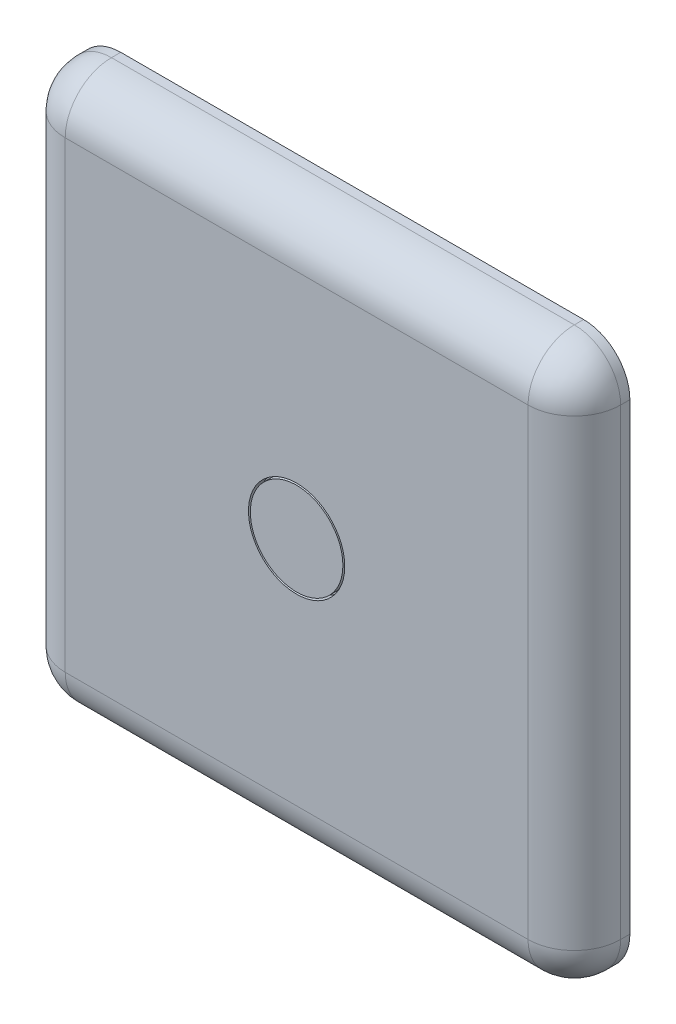
ISO-10303-21;
HEADER;
FILE_DESCRIPTION(('STEP AP214'),'2;1');
FILE_NAME('part.step','',(''),(''),'','','');
FILE_SCHEMA(('AUTOMOTIVE_DESIGN { 1 0 10303 214 1 1 1 1 }'));
ENDSEC;
DATA;
#1=APPLICATION_CONTEXT('core data for automotive mechanical design processes');
#2=APPLICATION_PROTOCOL_DEFINITION('international standard','automotive_design',2000,#1);
#3=PRODUCT_CONTEXT('',#1,'mechanical');
#4=PRODUCT('Part','Part','',(#3));
#5=PRODUCT_RELATED_PRODUCT_CATEGORY('part','',(#4));
#6=PRODUCT_DEFINITION_FORMATION('','',#4);
#7=PRODUCT_DEFINITION_CONTEXT('part definition',#1,'design');
#8=PRODUCT_DEFINITION('design','',#6,#7);
#9=PRODUCT_DEFINITION_SHAPE('','',#8);
#10=(LENGTH_UNIT() NAMED_UNIT(*) SI_UNIT(.MILLI.,.METRE.));
#11=(NAMED_UNIT(*) PLANE_ANGLE_UNIT() SI_UNIT($,.RADIAN.));
#12=(NAMED_UNIT(*) SI_UNIT($,.STERADIAN.) SOLID_ANGLE_UNIT());
#13=UNCERTAINTY_MEASURE_WITH_UNIT(LENGTH_MEASURE(1.E-05),#10,'distance_accuracy_value','');
#14=(GEOMETRIC_REPRESENTATION_CONTEXT(3) GLOBAL_UNCERTAINTY_ASSIGNED_CONTEXT((#13)) GLOBAL_UNIT_ASSIGNED_CONTEXT((#10,
#11,#12)) REPRESENTATION_CONTEXT('',''));
#15=CARTESIAN_POINT('',(0.,0.,0.));
#16=DIRECTION('',(0.,0.,1.));
#17=DIRECTION('',(1.,0.,0.));
#18=AXIS2_PLACEMENT_3D('',#15,#16,#17);
#19=CARTESIAN_POINT('',(15.,15.,-3.));
#20=DIRECTION('',(0.,0.,-1.));
#21=DIRECTION('',(-1.,0.,0.));
#22=AXIS2_PLACEMENT_3D('',#19,#20,#21);
#23=PLANE('',#22);
#24=CARTESIAN_POINT('',(15.,15.,-3.));
#25=DIRECTION('',(0.,0.,-1.));
#26=DIRECTION('',(-1.,0.,0.));
#27=AXIS2_PLACEMENT_3D('',#24,#25,#26);
#28=CIRCLE('',#27,2.5);
#29=CARTESIAN_POINT('',(17.5,15.,-3.));
#30=VERTEX_POINT('',#29);
#31=EDGE_CURVE('E17',#30,#30,#28,.T.);
#32=ORIENTED_EDGE('',*,*,#31,.T.);
#33=EDGE_LOOP('',(#32));
#34=FACE_BOUND('',#33,.T.);
#35=ADVANCED_FACE('F14',(#34),#23,.T.);
#36=CARTESIAN_POINT('',(15.,15.,3.));
#37=DIRECTION('',(0.,0.,-1.));
#38=DIRECTION('',(-1.,0.,0.));
#39=AXIS2_PLACEMENT_3D('',#36,#37,#38);
#40=CYLINDRICAL_SURFACE('',#39,2.5);
#41=CARTESIAN_POINT('',(15.,15.,-6.));
#42=DIRECTION('',(0.,0.,-1.));
#43=DIRECTION('',(-1.,0.,0.));
#44=AXIS2_PLACEMENT_3D('',#41,#42,#43);
#45=CIRCLE('',#44,2.5);
#46=CARTESIAN_POINT('',(12.5,15.,-6.));
#47=VERTEX_POINT('',#46);
#48=EDGE_CURVE('E32',#47,#47,#45,.T.);
#49=ORIENTED_EDGE('',*,*,#48,.T.);
#50=EDGE_LOOP('',(#49));
#51=FACE_BOUND('',#50,.T.);
#52=ORIENTED_EDGE('',*,*,#31,.F.);
#53=EDGE_LOOP('',(#52));
#54=FACE_BOUND('',#53,.T.);
#55=ADVANCED_FACE('F442',(#51,#54),#40,.F.);
#56=CARTESIAN_POINT('',(15.,15.,-6.));
#57=DIRECTION('',(0.,0.,1.));
#58=DIRECTION('',(1.,0.,0.));
#59=AXIS2_PLACEMENT_3D('',#56,#57,#58);
#60=PLANE('',#59);
#61=ORIENTED_EDGE('',*,*,#48,.F.);
#62=EDGE_LOOP('',(#61));
#63=FACE_BOUND('',#62,.T.);
#64=CARTESIAN_POINT('',(15.,15.,-6.00000000042655));
#65=DIRECTION('',(0.,0.,1.));
#66=DIRECTION('',(1.,0.,0.));
#67=AXIS2_PLACEMENT_3D('',#64,#65,#66);
#68=CIRCLE('',#67,2.75000000043292);
#69=CARTESIAN_POINT('',(12.2499999995671,15.,-6.00000000042655));
#70=VERTEX_POINT('',#69);
#71=EDGE_CURVE('E599',#70,#70,#68,.T.);
#72=ORIENTED_EDGE('',*,*,#71,.F.);
#73=EDGE_LOOP('',(#72));
#74=FACE_BOUND('',#73,.T.);
#75=ADVANCED_FACE('F439',(#63,#74),#60,.F.);
#76=CARTESIAN_POINT('',(15.,15.,-4.99999999954071));
#77=DIRECTION('',(0.,0.,1.));
#78=DIRECTION('',(1.,0.,0.));
#79=AXIS2_PLACEMENT_3D('',#76,#77,#78);
#80=CONICAL_SURFACE('',#79,3.74999999955662,0.785398162516375);
#81=CARTESIAN_POINT('',(15.,15.,-5.));
#82=DIRECTION('',(0.,0.,-1.));
#83=DIRECTION('',(-1.,0.,0.));
#84=AXIS2_PLACEMENT_3D('',#81,#82,#83);
#85=CIRCLE('',#84,3.75);
#86=CARTESIAN_POINT('',(11.2500000002217,15.,-4.99999999977035));
#87=VERTEX_POINT('',#86);
#88=EDGE_CURVE('E595',#87,#87,#85,.F.);
#89=ORIENTED_EDGE('',*,*,#88,.F.);
#90=EDGE_LOOP('',(#89));
#91=FACE_BOUND('',#90,.T.);
#92=ORIENTED_EDGE('',*,*,#71,.T.);
#93=EDGE_LOOP('',(#92));
#94=FACE_BOUND('',#93,.T.);
#95=ADVANCED_FACE('F435',(#91,#94),#80,.T.);
#96=CARTESIAN_POINT('',(15.,15.,0.));
#97=DIRECTION('',(0.,0.,-1.));
#98=DIRECTION('',(-1.,0.,0.));
#99=AXIS2_PLACEMENT_3D('',#96,#97,#98);
#100=CYLINDRICAL_SURFACE('',#99,3.75);
#101=ORIENTED_EDGE('',*,*,#88,.T.);
#102=EDGE_LOOP('',(#101));
#103=FACE_BOUND('',#102,.T.);
#104=CARTESIAN_POINT('',(15.,15.,0.));
#105=DIRECTION('',(0.,0.,-1.));
#106=DIRECTION('',(-1.,0.,0.));
#107=AXIS2_PLACEMENT_3D('',#104,#105,#106);
#108=CIRCLE('',#107,3.75);
#109=CARTESIAN_POINT('',(11.25,15.,0.));
#110=VERTEX_POINT('',#109);
#111=EDGE_CURVE('E598',#110,#110,#108,.T.);
#112=ORIENTED_EDGE('',*,*,#111,.T.);
#113=EDGE_LOOP('',(#112));
#114=FACE_BOUND('',#113,.T.);
#115=ADVANCED_FACE('F431',(#103,#114),#100,.T.);
#116=CARTESIAN_POINT('',(15.,15.,0.));
#117=DIRECTION('',(0.,0.,1.));
#118=DIRECTION('',(1.,0.,0.));
#119=AXIS2_PLACEMENT_3D('',#116,#117,#118);
#120=PLANE('',#119);
#121=ORIENTED_EDGE('',*,*,#111,.F.);
#122=EDGE_LOOP('',(#121));
#123=FACE_BOUND('',#122,.T.);
#124=CARTESIAN_POINT('',(15.,15.,0.));
#125=DIRECTION('',(0.,0.,-1.));
#126=DIRECTION('',(-1.,0.,0.));
#127=AXIS2_PLACEMENT_3D('',#124,#125,#126);
#128=CIRCLE('',#127,4.75);
#129=CARTESIAN_POINT('',(10.25,15.,0.));
#130=VERTEX_POINT('',#129);
#131=EDGE_CURVE('E589',#130,#130,#128,.F.);
#132=ORIENTED_EDGE('',*,*,#131,.F.);
#133=EDGE_LOOP('',(#132));
#134=FACE_BOUND('',#133,.T.);
#135=ADVANCED_FACE('F427',(#123,#134),#120,.F.);
#136=CARTESIAN_POINT('',(15.,15.,1.));
#137=DIRECTION('',(0.,0.,-1.));
#138=DIRECTION('',(-1.,0.,0.));
#139=AXIS2_PLACEMENT_3D('',#136,#137,#138);
#140=CYLINDRICAL_SURFACE('',#139,4.75);
#141=CARTESIAN_POINT('',(15.,15.,1.));
#142=DIRECTION('',(0.,0.,-1.));
#143=DIRECTION('',(-1.,0.,0.));
#144=AXIS2_PLACEMENT_3D('',#141,#142,#143);
#145=CIRCLE('',#144,4.75);
#146=CARTESIAN_POINT('',(10.25,15.,1.));
#147=VERTEX_POINT('',#146);
#148=EDGE_CURVE('E588',#147,#147,#145,.T.);
#149=ORIENTED_EDGE('',*,*,#148,.T.);
#150=EDGE_LOOP('',(#149));
#151=FACE_BOUND('',#150,.T.);
#152=ORIENTED_EDGE('',*,*,#131,.T.);
#153=EDGE_LOOP('',(#152));
#154=FACE_BOUND('',#153,.T.);
#155=ADVANCED_FACE('F423',(#151,#154),#140,.T.);
#156=CARTESIAN_POINT('',(30.,30.,1.));
#157=DIRECTION('',(0.,0.,1.));
#158=DIRECTION('',(1.,0.,0.));
#159=AXIS2_PLACEMENT_3D('',#156,#157,#158);
#160=PLANE('',#159);
#161=ORIENTED_EDGE('',*,*,#148,.F.);
#162=EDGE_LOOP('',(#161));
#163=FACE_BOUND('',#162,.T.);
#164=DIRECTION('',(1.,0.,0.));
#165=VECTOR('',#164,1.);
#166=CARTESIAN_POINT('',(15.,27.5,1.));
#167=LINE('',#166,#165);
#168=CARTESIAN_POINT('',(2.5,27.5,1.));
#169=VERTEX_POINT('',#168);
#170=CARTESIAN_POINT('',(27.5,27.5,1.));
#171=VERTEX_POINT('',#170);
#172=EDGE_CURVE('E559',#169,#171,#167,.T.);
#173=ORIENTED_EDGE('',*,*,#172,.T.);
#174=DIRECTION('',(0.,-1.,0.));
#175=VECTOR('',#174,1.);
#176=CARTESIAN_POINT('',(27.5,30.,1.));
#177=LINE('',#176,#175);
#178=CARTESIAN_POINT('',(27.5,2.5,1.));
#179=VERTEX_POINT('',#178);
#180=EDGE_CURVE('E355',#171,#179,#177,.T.);
#181=ORIENTED_EDGE('',*,*,#180,.T.);
#182=DIRECTION('',(-1.,0.,0.));
#183=VECTOR('',#182,1.);
#184=CARTESIAN_POINT('',(30.,2.5,1.));
#185=LINE('',#184,#183);
#186=CARTESIAN_POINT('',(2.5,2.5,1.));
#187=VERTEX_POINT('',#186);
#188=EDGE_CURVE('E586',#179,#187,#185,.T.);
#189=ORIENTED_EDGE('',*,*,#188,.T.);
#190=DIRECTION('',(0.,1.,0.));
#191=VECTOR('',#190,1.);
#192=CARTESIAN_POINT('',(2.5,15.,1.));
#193=LINE('',#192,#191);
#194=EDGE_CURVE('E398',#187,#169,#193,.T.);
#195=ORIENTED_EDGE('',*,*,#194,.T.);
#196=EDGE_LOOP('',(#173,#181,#189,#195));
#197=FACE_BOUND('',#196,.T.);
#198=ADVANCED_FACE('F419',(#163,#197),#160,.F.);
#199=CARTESIAN_POINT('',(30.,2.5,0.5));
#200=DIRECTION('',(-1.,0.,0.));
#201=DIRECTION('',(0.,0.,1.));
#202=AXIS2_PLACEMENT_3D('',#199,#200,#201);
#203=CYLINDRICAL_SURFACE('',#202,0.5);
#204=CARTESIAN_POINT('',(2.5,2.5,0.5));
#205=DIRECTION('',(1.,0.,0.));
#206=DIRECTION('',(0.,1.,0.));
#207=AXIS2_PLACEMENT_3D('',#204,#205,#206);
#208=CIRCLE('',#207,0.5);
#209=CARTESIAN_POINT('',(2.5,2.,0.5));
#210=VERTEX_POINT('',#209);
#211=EDGE_CURVE('E406',#210,#187,#208,.F.);
#212=ORIENTED_EDGE('',*,*,#211,.T.);
#213=ORIENTED_EDGE('',*,*,#188,.F.);
#214=CARTESIAN_POINT('',(27.5,2.5,0.5));
#215=DIRECTION('',(1.,0.,0.));
#216=DIRECTION('',(0.,1.,0.));
#217=AXIS2_PLACEMENT_3D('',#214,#215,#216);
#218=CIRCLE('',#217,0.5);
#219=CARTESIAN_POINT('',(27.5,2.,0.5));
#220=VERTEX_POINT('',#219);
#221=EDGE_CURVE('E354',#179,#220,#218,.T.);
#222=ORIENTED_EDGE('',*,*,#221,.T.);
#223=DIRECTION('',(1.,0.,0.));
#224=VECTOR('',#223,1.);
#225=CARTESIAN_POINT('',(30.,2.,0.5));
#226=LINE('',#225,#224);
#227=EDGE_CURVE('E361',#220,#210,#226,.F.);
#228=ORIENTED_EDGE('',*,*,#227,.T.);
#229=EDGE_LOOP('',(#212,#213,#222,#228));
#230=FACE_BOUND('',#229,.T.);
#231=ADVANCED_FACE('F415',(#230),#203,.F.);
#232=CARTESIAN_POINT('',(2.5,2.5,0.5));
#233=DIRECTION('',(1.,0.,0.));
#234=DIRECTION('',(0.,1.,0.));
#235=AXIS2_PLACEMENT_3D('',#232,#233,#234);
#236=SPHERICAL_SURFACE('',#235,0.5);
#237=CARTESIAN_POINT('',(2.5,2.5,0.5));
#238=DIRECTION('',(0.,1.,0.));
#239=DIRECTION('',(0.,0.,1.));
#240=AXIS2_PLACEMENT_3D('',#237,#238,#239);
#241=CIRCLE('',#240,0.5);
#242=CARTESIAN_POINT('',(2.,2.5,0.5));
#243=VERTEX_POINT('',#242);
#244=EDGE_CURVE('E403',#243,#187,#241,.T.);
#245=ORIENTED_EDGE('',*,*,#244,.T.);
#246=ORIENTED_EDGE('',*,*,#211,.F.);
#247=CARTESIAN_POINT('',(2.5,2.5,0.5));
#248=DIRECTION('',(0.,0.,1.));
#249=DIRECTION('',(1.,0.,0.));
#250=AXIS2_PLACEMENT_3D('',#247,#248,#249);
#251=CIRCLE('',#250,0.5);
#252=EDGE_CURVE('E407',#210,#243,#251,.F.);
#253=ORIENTED_EDGE('',*,*,#252,.T.);
#254=EDGE_LOOP('',(#245,#246,#253));
#255=FACE_BOUND('',#254,.T.);
#256=ADVANCED_FACE('F412',(#255),#236,.F.);
#257=CARTESIAN_POINT('',(2.5,15.,0.5));
#258=DIRECTION('',(0.,1.,0.));
#259=DIRECTION('',(0.,0.,1.));
#260=AXIS2_PLACEMENT_3D('',#257,#258,#259);
#261=CYLINDRICAL_SURFACE('',#260,0.5);
#262=CARTESIAN_POINT('',(2.5,27.5,0.5));
#263=DIRECTION('',(0.,-1.,0.));
#264=DIRECTION('',(1.,0.,0.));
#265=AXIS2_PLACEMENT_3D('',#262,#263,#264);
#266=CIRCLE('',#265,0.5);
#267=CARTESIAN_POINT('',(2.,27.5,0.5));
#268=VERTEX_POINT('',#267);
#269=EDGE_CURVE('E394',#268,#169,#266,.F.);
#270=ORIENTED_EDGE('',*,*,#269,.T.);
#271=ORIENTED_EDGE('',*,*,#194,.F.);
#272=ORIENTED_EDGE('',*,*,#244,.F.);
#273=DIRECTION('',(0.,1.,0.));
#274=VECTOR('',#273,1.);
#275=CARTESIAN_POINT('',(2.,0.,0.5));
#276=LINE('',#275,#274);
#277=EDGE_CURVE('E399',#243,#268,#276,.T.);
#278=ORIENTED_EDGE('',*,*,#277,.T.);
#279=EDGE_LOOP('',(#270,#271,#272,#278));
#280=FACE_BOUND('',#279,.T.);
#281=ADVANCED_FACE('F386',(#280),#261,.F.);
#282=CARTESIAN_POINT('',(2.5,27.5,0.5));
#283=DIRECTION('',(1.,0.,0.));
#284=DIRECTION('',(0.,1.,0.));
#285=AXIS2_PLACEMENT_3D('',#282,#283,#284);
#286=SPHERICAL_SURFACE('',#285,0.5);
#287=CARTESIAN_POINT('',(2.5,27.5,0.5));
#288=DIRECTION('',(1.,0.,0.));
#289=DIRECTION('',(0.,0.,-1.));
#290=AXIS2_PLACEMENT_3D('',#287,#288,#289);
#291=CIRCLE('',#290,0.5);
#292=CARTESIAN_POINT('',(2.5,28.,0.5));
#293=VERTEX_POINT('',#292);
#294=EDGE_CURVE('E397',#293,#169,#291,.T.);
#295=ORIENTED_EDGE('',*,*,#294,.T.);
#296=ORIENTED_EDGE('',*,*,#269,.F.);
#297=CARTESIAN_POINT('',(2.5,27.5,0.5));
#298=DIRECTION('',(0.,0.,1.));
#299=DIRECTION('',(1.,0.,0.));
#300=AXIS2_PLACEMENT_3D('',#297,#298,#299);
#301=CIRCLE('',#300,0.5);
#302=EDGE_CURVE('E392',#268,#293,#301,.F.);
#303=ORIENTED_EDGE('',*,*,#302,.T.);
#304=EDGE_LOOP('',(#295,#296,#303));
#305=FACE_BOUND('',#304,.T.);
#306=ADVANCED_FACE('F381',(#305),#286,.F.);
#307=CARTESIAN_POINT('',(15.,27.5,0.5));
#308=DIRECTION('',(1.,0.,0.));
#309=DIRECTION('',(0.,0.,-1.));
#310=AXIS2_PLACEMENT_3D('',#307,#308,#309);
#311=CYLINDRICAL_SURFACE('',#310,0.5);
#312=CARTESIAN_POINT('',(27.5,27.5,0.5));
#313=DIRECTION('',(1.,0.,0.));
#314=DIRECTION('',(0.,1.,0.));
#315=AXIS2_PLACEMENT_3D('',#312,#313,#314);
#316=CIRCLE('',#315,0.5);
#317=CARTESIAN_POINT('',(27.5,28.,0.5));
#318=VERTEX_POINT('',#317);
#319=EDGE_CURVE('E367',#318,#171,#316,.T.);
#320=ORIENTED_EDGE('',*,*,#319,.T.);
#321=ORIENTED_EDGE('',*,*,#172,.F.);
#322=ORIENTED_EDGE('',*,*,#294,.F.);
#323=DIRECTION('',(1.,0.,0.));
#324=VECTOR('',#323,1.);
#325=CARTESIAN_POINT('',(0.,28.,0.5));
#326=LINE('',#325,#324);
#327=EDGE_CURVE('E529',#293,#318,#326,.T.);
#328=ORIENTED_EDGE('',*,*,#327,.T.);
#329=EDGE_LOOP('',(#320,#321,#322,#328));
#330=FACE_BOUND('',#329,.T.);
#331=ADVANCED_FACE('F377',(#330),#311,.F.);
#332=CARTESIAN_POINT('',(27.5,27.5,0.5));
#333=DIRECTION('',(1.,0.,0.));
#334=DIRECTION('',(0.,1.,0.));
#335=AXIS2_PLACEMENT_3D('',#332,#333,#334);
#336=SPHERICAL_SURFACE('',#335,0.5);
#337=CARTESIAN_POINT('',(27.5,27.5,0.5));
#338=DIRECTION('',(0.,-1.,0.));
#339=DIRECTION('',(0.,0.,-1.));
#340=AXIS2_PLACEMENT_3D('',#337,#338,#339);
#341=CIRCLE('',#340,0.5);
#342=CARTESIAN_POINT('',(28.,27.5,0.5));
#343=VERTEX_POINT('',#342);
#344=EDGE_CURVE('E364',#343,#171,#341,.T.);
#345=ORIENTED_EDGE('',*,*,#344,.T.);
#346=ORIENTED_EDGE('',*,*,#319,.F.);
#347=CARTESIAN_POINT('',(27.5,27.5,0.5));
#348=DIRECTION('',(0.,0.,1.));
#349=DIRECTION('',(1.,0.,0.));
#350=AXIS2_PLACEMENT_3D('',#347,#348,#349);
#351=CIRCLE('',#350,0.5);
#352=EDGE_CURVE('E368',#318,#343,#351,.F.);
#353=ORIENTED_EDGE('',*,*,#352,.T.);
#354=EDGE_LOOP('',(#345,#346,#353));
#355=FACE_BOUND('',#354,.T.);
#356=ADVANCED_FACE('F374',(#355),#336,.F.);
#357=CARTESIAN_POINT('',(27.5,30.,0.5));
#358=DIRECTION('',(0.,-1.,0.));
#359=DIRECTION('',(0.,0.,-1.));
#360=AXIS2_PLACEMENT_3D('',#357,#358,#359);
#361=CYLINDRICAL_SURFACE('',#360,0.5);
#362=CARTESIAN_POINT('',(27.5,2.5,0.5));
#363=DIRECTION('',(0.,-1.,0.));
#364=DIRECTION('',(1.,0.,0.));
#365=AXIS2_PLACEMENT_3D('',#362,#363,#364);
#366=CIRCLE('',#365,0.5);
#367=CARTESIAN_POINT('',(28.,2.5,0.5));
#368=VERTEX_POINT('',#367);
#369=EDGE_CURVE('E351',#368,#179,#366,.T.);
#370=ORIENTED_EDGE('',*,*,#369,.T.);
#371=ORIENTED_EDGE('',*,*,#180,.F.);
#372=ORIENTED_EDGE('',*,*,#344,.F.);
#373=DIRECTION('',(0.,1.,0.));
#374=VECTOR('',#373,1.);
#375=CARTESIAN_POINT('',(28.,30.,0.5));
#376=LINE('',#375,#374);
#377=EDGE_CURVE('E347',#343,#368,#376,.F.);
#378=ORIENTED_EDGE('',*,*,#377,.T.);
#379=EDGE_LOOP('',(#370,#371,#372,#378));
#380=FACE_BOUND('',#379,.T.);
#381=ADVANCED_FACE('F339',(#380),#361,.F.);
#382=CARTESIAN_POINT('',(27.5,2.5,0.5));
#383=DIRECTION('',(1.,0.,0.));
#384=DIRECTION('',(0.,1.,0.));
#385=AXIS2_PLACEMENT_3D('',#382,#383,#384);
#386=SPHERICAL_SURFACE('',#385,0.5);
#387=ORIENTED_EDGE('',*,*,#221,.F.);
#388=ORIENTED_EDGE('',*,*,#369,.F.);
#389=CARTESIAN_POINT('',(27.5,2.5,0.5));
#390=DIRECTION('',(0.,0.,1.));
#391=DIRECTION('',(1.,0.,0.));
#392=AXIS2_PLACEMENT_3D('',#389,#390,#391);
#393=CIRCLE('',#392,0.5);
#394=EDGE_CURVE('E356',#368,#220,#393,.F.);
#395=ORIENTED_EDGE('',*,*,#394,.T.);
#396=EDGE_LOOP('',(#387,#388,#395));
#397=FACE_BOUND('',#396,.T.);
#398=ADVANCED_FACE('F334',(#397),#386,.F.);
#399=CARTESIAN_POINT('',(30.,2.,0.));
#400=DIRECTION('',(0.,-1.,0.));
#401=DIRECTION('',(0.,0.,-1.));
#402=AXIS2_PLACEMENT_3D('',#399,#400,#401);
#403=PLANE('',#402);
#404=DIRECTION('',(0.,0.,1.));
#405=VECTOR('',#404,1.);
#406=CARTESIAN_POINT('',(27.5,2.,0.));
#407=LINE('',#406,#405);
#408=CARTESIAN_POINT('',(27.5,2.,0.));
#409=VERTEX_POINT('',#408);
#410=EDGE_CURVE('E349',#220,#409,#407,.F.);
#411=ORIENTED_EDGE('',*,*,#410,.T.);
#412=DIRECTION('',(1.,0.,0.));
#413=VECTOR('',#412,1.);
#414=CARTESIAN_POINT('',(15.,2.,0.));
#415=LINE('',#414,#413);
#416=CARTESIAN_POINT('',(2.5,2.,0.));
#417=VERTEX_POINT('',#416);
#418=EDGE_CURVE('E584',#409,#417,#415,.F.);
#419=ORIENTED_EDGE('',*,*,#418,.T.);
#420=DIRECTION('',(0.,0.,1.));
#421=VECTOR('',#420,1.);
#422=CARTESIAN_POINT('',(2.5,2.,0.));
#423=LINE('',#422,#421);
#424=EDGE_CURVE('E345',#417,#210,#423,.T.);
#425=ORIENTED_EDGE('',*,*,#424,.T.);
#426=ORIENTED_EDGE('',*,*,#227,.F.);
#427=EDGE_LOOP('',(#411,#419,#425,#426));
#428=FACE_BOUND('',#427,.T.);
#429=ADVANCED_FACE('F330',(#428),#403,.F.);
#430=CARTESIAN_POINT('',(2.5,2.5,0.));
#431=DIRECTION('',(0.,0.,1.));
#432=DIRECTION('',(1.,0.,0.));
#433=AXIS2_PLACEMENT_3D('',#430,#431,#432);
#434=CYLINDRICAL_SURFACE('',#433,0.5);
#435=ORIENTED_EDGE('',*,*,#424,.F.);
#436=CARTESIAN_POINT('',(2.5,2.5,0.));
#437=DIRECTION('',(0.,0.,1.));
#438=DIRECTION('',(1.,0.,0.));
#439=AXIS2_PLACEMENT_3D('',#436,#437,#438);
#440=CIRCLE('',#439,0.5);
#441=CARTESIAN_POINT('',(2.,2.5,0.));
#442=VERTEX_POINT('',#441);
#443=EDGE_CURVE('E540',#417,#442,#440,.F.);
#444=ORIENTED_EDGE('',*,*,#443,.T.);
#445=DIRECTION('',(0.,0.,1.));
#446=VECTOR('',#445,1.);
#447=CARTESIAN_POINT('',(2.,2.5,0.));
#448=LINE('',#447,#446);
#449=EDGE_CURVE('E402',#442,#243,#448,.T.);
#450=ORIENTED_EDGE('',*,*,#449,.T.);
#451=ORIENTED_EDGE('',*,*,#252,.F.);
#452=EDGE_LOOP('',(#435,#444,#450,#451));
#453=FACE_BOUND('',#452,.T.);
#454=ADVANCED_FACE('F326',(#453),#434,.F.);
#455=CARTESIAN_POINT('',(2.,0.,0.));
#456=DIRECTION('',(-1.,0.,0.));
#457=DIRECTION('',(0.,0.,1.));
#458=AXIS2_PLACEMENT_3D('',#455,#456,#457);
#459=PLANE('',#458);
#460=ORIENTED_EDGE('',*,*,#449,.F.);
#461=DIRECTION('',(0.,1.,0.));
#462=VECTOR('',#461,1.);
#463=CARTESIAN_POINT('',(2.,15.,0.));
#464=LINE('',#463,#462);
#465=CARTESIAN_POINT('',(2.,27.5,0.));
#466=VERTEX_POINT('',#465);
#467=EDGE_CURVE('E548',#442,#466,#464,.T.);
#468=ORIENTED_EDGE('',*,*,#467,.T.);
#469=DIRECTION('',(0.,0.,1.));
#470=VECTOR('',#469,1.);
#471=CARTESIAN_POINT('',(2.,27.5,0.));
#472=LINE('',#471,#470);
#473=EDGE_CURVE('E401',#466,#268,#472,.T.);
#474=ORIENTED_EDGE('',*,*,#473,.T.);
#475=ORIENTED_EDGE('',*,*,#277,.F.);
#476=EDGE_LOOP('',(#460,#468,#474,#475));
#477=FACE_BOUND('',#476,.T.);
#478=ADVANCED_FACE('F322',(#477),#459,.F.);
#479=CARTESIAN_POINT('',(2.5,27.5,0.));
#480=DIRECTION('',(0.,0.,1.));
#481=DIRECTION('',(1.,0.,0.));
#482=AXIS2_PLACEMENT_3D('',#479,#480,#481);
#483=CYLINDRICAL_SURFACE('',#482,0.5);
#484=ORIENTED_EDGE('',*,*,#473,.F.);
#485=CARTESIAN_POINT('',(2.5,27.5,0.));
#486=DIRECTION('',(0.,0.,1.));
#487=DIRECTION('',(1.,0.,0.));
#488=AXIS2_PLACEMENT_3D('',#485,#486,#487);
#489=CIRCLE('',#488,0.5);
#490=CARTESIAN_POINT('',(2.5,28.,0.));
#491=VERTEX_POINT('',#490);
#492=EDGE_CURVE('E555',#466,#491,#489,.F.);
#493=ORIENTED_EDGE('',*,*,#492,.T.);
#494=DIRECTION('',(0.,0.,1.));
#495=VECTOR('',#494,1.);
#496=CARTESIAN_POINT('',(2.5,28.,0.));
#497=LINE('',#496,#495);
#498=EDGE_CURVE('E530',#491,#293,#497,.T.);
#499=ORIENTED_EDGE('',*,*,#498,.T.);
#500=ORIENTED_EDGE('',*,*,#302,.F.);
#501=EDGE_LOOP('',(#484,#493,#499,#500));
#502=FACE_BOUND('',#501,.T.);
#503=ADVANCED_FACE('F318',(#502),#483,.F.);
#504=CARTESIAN_POINT('',(0.,28.,0.));
#505=DIRECTION('',(0.,1.,0.));
#506=DIRECTION('',(0.,0.,1.));
#507=AXIS2_PLACEMENT_3D('',#504,#505,#506);
#508=PLANE('',#507);
#509=ORIENTED_EDGE('',*,*,#498,.F.);
#510=DIRECTION('',(1.,0.,0.));
#511=VECTOR('',#510,1.);
#512=CARTESIAN_POINT('',(15.,28.,0.));
#513=LINE('',#512,#511);
#514=CARTESIAN_POINT('',(27.5,28.,0.));
#515=VERTEX_POINT('',#514);
#516=EDGE_CURVE('E562',#491,#515,#513,.T.);
#517=ORIENTED_EDGE('',*,*,#516,.T.);
#518=DIRECTION('',(0.,0.,1.));
#519=VECTOR('',#518,1.);
#520=CARTESIAN_POINT('',(27.5,28.,0.));
#521=LINE('',#520,#519);
#522=EDGE_CURVE('E370',#515,#318,#521,.T.);
#523=ORIENTED_EDGE('',*,*,#522,.T.);
#524=ORIENTED_EDGE('',*,*,#327,.F.);
#525=EDGE_LOOP('',(#509,#517,#523,#524));
#526=FACE_BOUND('',#525,.T.);
#527=ADVANCED_FACE('F314',(#526),#508,.F.);
#528=CARTESIAN_POINT('',(27.5,27.5,0.));
#529=DIRECTION('',(0.,0.,1.));
#530=DIRECTION('',(1.,0.,0.));
#531=AXIS2_PLACEMENT_3D('',#528,#529,#530);
#532=CYLINDRICAL_SURFACE('',#531,0.5);
#533=ORIENTED_EDGE('',*,*,#522,.F.);
#534=CARTESIAN_POINT('',(27.5,27.5,0.));
#535=DIRECTION('',(0.,0.,1.));
#536=DIRECTION('',(1.,0.,0.));
#537=AXIS2_PLACEMENT_3D('',#534,#535,#536);
#538=CIRCLE('',#537,0.5);
#539=CARTESIAN_POINT('',(28.,27.5,0.));
#540=VERTEX_POINT('',#539);
#541=EDGE_CURVE('E568',#515,#540,#538,.F.);
#542=ORIENTED_EDGE('',*,*,#541,.T.);
#543=DIRECTION('',(0.,0.,-1.));
#544=VECTOR('',#543,1.);
#545=CARTESIAN_POINT('',(28.,27.5,0.));
#546=LINE('',#545,#544);
#547=EDGE_CURVE('E350',#540,#343,#546,.F.);
#548=ORIENTED_EDGE('',*,*,#547,.T.);
#549=ORIENTED_EDGE('',*,*,#352,.F.);
#550=EDGE_LOOP('',(#533,#542,#548,#549));
#551=FACE_BOUND('',#550,.T.);
#552=ADVANCED_FACE('F310',(#551),#532,.F.);
#553=CARTESIAN_POINT('',(28.,30.,0.));
#554=DIRECTION('',(1.,0.,0.));
#555=DIRECTION('',(0.,0.,-1.));
#556=AXIS2_PLACEMENT_3D('',#553,#554,#555);
#557=PLANE('',#556);
#558=ORIENTED_EDGE('',*,*,#547,.F.);
#559=DIRECTION('',(0.,1.,0.));
#560=VECTOR('',#559,1.);
#561=CARTESIAN_POINT('',(28.,15.,0.));
#562=LINE('',#561,#560);
#563=CARTESIAN_POINT('',(28.,2.5,0.));
#564=VERTEX_POINT('',#563);
#565=EDGE_CURVE('E261',#540,#564,#562,.F.);
#566=ORIENTED_EDGE('',*,*,#565,.T.);
#567=DIRECTION('',(0.,0.,1.));
#568=VECTOR('',#567,1.);
#569=CARTESIAN_POINT('',(28.,2.5,0.));
#570=LINE('',#569,#568);
#571=EDGE_CURVE('E360',#564,#368,#570,.T.);
#572=ORIENTED_EDGE('',*,*,#571,.T.);
#573=ORIENTED_EDGE('',*,*,#377,.F.);
#574=EDGE_LOOP('',(#558,#566,#572,#573));
#575=FACE_BOUND('',#574,.T.);
#576=ADVANCED_FACE('F306',(#575),#557,.F.);
#577=CARTESIAN_POINT('',(27.5,2.5,0.));
#578=DIRECTION('',(0.,0.,1.));
#579=DIRECTION('',(1.,0.,0.));
#580=AXIS2_PLACEMENT_3D('',#577,#578,#579);
#581=CYLINDRICAL_SURFACE('',#580,0.5);
#582=ORIENTED_EDGE('',*,*,#571,.F.);
#583=CARTESIAN_POINT('',(27.5,2.5,0.));
#584=DIRECTION('',(0.,0.,1.));
#585=DIRECTION('',(1.,0.,0.));
#586=AXIS2_PLACEMENT_3D('',#583,#584,#585);
#587=CIRCLE('',#586,0.5);
#588=EDGE_CURVE('E580',#564,#409,#587,.F.);
#589=ORIENTED_EDGE('',*,*,#588,.T.);
#590=ORIENTED_EDGE('',*,*,#410,.F.);
#591=ORIENTED_EDGE('',*,*,#394,.F.);
#592=EDGE_LOOP('',(#582,#589,#590,#591));
#593=FACE_BOUND('',#592,.T.);
#594=ADVANCED_FACE('F302',(#593),#581,.F.);
#595=CARTESIAN_POINT('',(30.,30.,3.));
#596=DIRECTION('',(0.,0.,1.));
#597=DIRECTION('',(1.,0.,0.));
#598=AXIS2_PLACEMENT_3D('',#595,#596,#597);
#599=PLANE('',#598);
#600=CARTESIAN_POINT('',(15.,15.,3.));
#601=DIRECTION('',(0.,0.,-1.));
#602=DIRECTION('',(-1.,0.,0.));
#603=AXIS2_PLACEMENT_3D('',#600,#601,#602);
#604=CIRCLE('',#603,2.5);
#605=CARTESIAN_POINT('',(17.5,15.,3.));
#606=VERTEX_POINT('',#605);
#607=EDGE_CURVE('E510',#606,#606,#604,.T.);
#608=ORIENTED_EDGE('',*,*,#607,.F.);
#609=EDGE_LOOP('',(#608));
#610=FACE_BOUND('',#609,.T.);
#611=ADVANCED_FACE('F298',(#610),#599,.T.);
#612=CARTESIAN_POINT('',(2.5,2.5,0.));
#613=DIRECTION('',(0.,0.,1.));
#614=DIRECTION('',(1.,0.,0.));
#615=AXIS2_PLACEMENT_3D('',#612,#613,#614);
#616=CYLINDRICAL_SURFACE('',#615,2.5);
#617=CARTESIAN_POINT('',(2.5,2.5,0.));
#618=DIRECTION('',(0.,0.,1.));
#619=DIRECTION('',(1.,0.,0.));
#620=AXIS2_PLACEMENT_3D('',#617,#618,#619);
#621=CIRCLE('',#620,2.5);
#622=CARTESIAN_POINT('',(0.,2.5,0.));
#623=VERTEX_POINT('',#622);
#624=CARTESIAN_POINT('',(2.5,0.,0.));
#625=VERTEX_POINT('',#624);
#626=EDGE_CURVE('E359',#623,#625,#621,.T.);
#627=ORIENTED_EDGE('',*,*,#626,.T.);
#628=DIRECTION('',(0.,0.,-1.));
#629=VECTOR('',#628,1.);
#630=CARTESIAN_POINT('',(2.5,0.,0.));
#631=LINE('',#630,#629);
#632=CARTESIAN_POINT('',(2.5,0.,0.499999999999521));
#633=VERTEX_POINT('',#632);
#634=EDGE_CURVE('E491',#633,#625,#631,.T.);
#635=ORIENTED_EDGE('',*,*,#634,.F.);
#636=CARTESIAN_POINT('',(2.5,2.5,0.5));
#637=DIRECTION('',(0.,1.5328734877225E-12,-1.));
#638=DIRECTION('',(1.,0.,0.));
#639=AXIS2_PLACEMENT_3D('',#636,#637,#638);
#640=CIRCLE('',#639,2.5);
#641=CARTESIAN_POINT('',(0.,2.5,0.5));
#642=VERTEX_POINT('',#641);
#643=EDGE_CURVE('E501',#642,#633,#640,.F.);
#644=ORIENTED_EDGE('',*,*,#643,.F.);
#645=DIRECTION('',(0.,0.,1.));
#646=VECTOR('',#645,1.);
#647=CARTESIAN_POINT('',(0.,2.5,0.));
#648=LINE('',#647,#646);
#649=EDGE_CURVE('E495',#623,#642,#648,.T.);
#650=ORIENTED_EDGE('',*,*,#649,.F.);
#651=EDGE_LOOP('',(#627,#635,#644,#650));
#652=FACE_BOUND('',#651,.T.);
#653=ADVANCED_FACE('F294',(#652),#616,.T.);
#654=CARTESIAN_POINT('',(27.5,2.5,0.));
#655=DIRECTION('',(0.,0.,1.));
#656=DIRECTION('',(1.,0.,0.));
#657=AXIS2_PLACEMENT_3D('',#654,#655,#656);
#658=CYLINDRICAL_SURFACE('',#657,2.5);
#659=CARTESIAN_POINT('',(27.5,2.5,0.));
#660=DIRECTION('',(0.,0.,1.));
#661=DIRECTION('',(1.,0.,0.));
#662=AXIS2_PLACEMENT_3D('',#659,#660,#661);
#663=CIRCLE('',#662,2.5);
#664=CARTESIAN_POINT('',(27.5,0.,0.));
#665=VERTEX_POINT('',#664);
#666=CARTESIAN_POINT('',(30.,2.5,0.));
#667=VERTEX_POINT('',#666);
#668=EDGE_CURVE('E614',#665,#667,#663,.T.);
#669=ORIENTED_EDGE('',*,*,#668,.T.);
#670=DIRECTION('',(0.,0.,-1.));
#671=VECTOR('',#670,1.);
#672=CARTESIAN_POINT('',(30.,2.5,0.));
#673=LINE('',#672,#671);
#674=CARTESIAN_POINT('',(30.,2.5,0.5));
#675=VERTEX_POINT('',#674);
#676=EDGE_CURVE('E504',#675,#667,#673,.T.);
#677=ORIENTED_EDGE('',*,*,#676,.F.);
#678=CARTESIAN_POINT('',(27.5,2.5,0.5));
#679=DIRECTION('',(0.,0.,-1.));
#680=DIRECTION('',(1.,0.,0.));
#681=AXIS2_PLACEMENT_3D('',#678,#679,#680);
#682=CIRCLE('',#681,2.5);
#683=CARTESIAN_POINT('',(27.5,0.,0.5));
#684=VERTEX_POINT('',#683);
#685=EDGE_CURVE('E485',#684,#675,#682,.F.);
#686=ORIENTED_EDGE('',*,*,#685,.F.);
#687=DIRECTION('',(0.,0.,-1.));
#688=VECTOR('',#687,1.);
#689=CARTESIAN_POINT('',(27.5,0.,0.));
#690=LINE('',#689,#688);
#691=EDGE_CURVE('E498',#665,#684,#690,.F.);
#692=ORIENTED_EDGE('',*,*,#691,.F.);
#693=EDGE_LOOP('',(#669,#677,#686,#692));
#694=FACE_BOUND('',#693,.T.);
#695=ADVANCED_FACE('F290',(#694),#658,.T.);
#696=CARTESIAN_POINT('',(15.,15.,0.));
#697=DIRECTION('',(0.,0.,1.));
#698=DIRECTION('',(1.,0.,0.));
#699=AXIS2_PLACEMENT_3D('',#696,#697,#698);
#700=PLANE('',#699);
#701=ORIENTED_EDGE('',*,*,#565,.F.);
#702=ORIENTED_EDGE('',*,*,#541,.F.);
#703=ORIENTED_EDGE('',*,*,#516,.F.);
#704=ORIENTED_EDGE('',*,*,#492,.F.);
#705=ORIENTED_EDGE('',*,*,#467,.F.);
#706=ORIENTED_EDGE('',*,*,#443,.F.);
#707=ORIENTED_EDGE('',*,*,#418,.F.);
#708=ORIENTED_EDGE('',*,*,#588,.F.);
#709=EDGE_LOOP('',(#701,#702,#703,#704,#705,#706,#707,#708));
#710=FACE_BOUND('',#709,.T.);
#711=DIRECTION('',(1.,0.,0.));
#712=VECTOR('',#711,1.);
#713=CARTESIAN_POINT('',(30.,0.,0.));
#714=LINE('',#713,#712);
#715=EDGE_CURVE('E494',#625,#665,#714,.T.);
#716=ORIENTED_EDGE('',*,*,#715,.F.);
#717=ORIENTED_EDGE('',*,*,#626,.F.);
#718=DIRECTION('',(0.,1.,0.));
#719=VECTOR('',#718,1.);
#720=CARTESIAN_POINT('',(0.,0.,0.));
#721=LINE('',#720,#719);
#722=CARTESIAN_POINT('',(0.,27.5,0.));
#723=VERTEX_POINT('',#722);
#724=EDGE_CURVE('E509',#723,#623,#721,.F.);
#725=ORIENTED_EDGE('',*,*,#724,.F.);
#726=CARTESIAN_POINT('',(2.5,27.5,0.));
#727=DIRECTION('',(0.,0.,1.));
#728=DIRECTION('',(1.,0.,0.));
#729=AXIS2_PLACEMENT_3D('',#726,#727,#728);
#730=CIRCLE('',#729,2.5);
#731=CARTESIAN_POINT('',(2.5,30.,0.));
#732=VERTEX_POINT('',#731);
#733=EDGE_CURVE('E608',#732,#723,#730,.T.);
#734=ORIENTED_EDGE('',*,*,#733,.F.);
#735=DIRECTION('',(1.,0.,0.));
#736=VECTOR('',#735,1.);
#737=CARTESIAN_POINT('',(0.,30.,0.));
#738=LINE('',#737,#736);
#739=CARTESIAN_POINT('',(27.5,30.,0.));
#740=VERTEX_POINT('',#739);
#741=EDGE_CURVE('E636',#740,#732,#738,.F.);
#742=ORIENTED_EDGE('',*,*,#741,.F.);
#743=CARTESIAN_POINT('',(27.5,27.5,0.));
#744=DIRECTION('',(0.,0.,1.));
#745=DIRECTION('',(1.,0.,0.));
#746=AXIS2_PLACEMENT_3D('',#743,#744,#745);
#747=CIRCLE('',#746,2.5);
#748=CARTESIAN_POINT('',(30.,27.5,0.));
#749=VERTEX_POINT('',#748);
#750=EDGE_CURVE('E606',#749,#740,#747,.T.);
#751=ORIENTED_EDGE('',*,*,#750,.F.);
#752=DIRECTION('',(0.,1.,0.));
#753=VECTOR('',#752,1.);
#754=CARTESIAN_POINT('',(30.,30.,0.));
#755=LINE('',#754,#753);
#756=EDGE_CURVE('E649',#667,#749,#755,.T.);
#757=ORIENTED_EDGE('',*,*,#756,.F.);
#758=ORIENTED_EDGE('',*,*,#668,.F.);
#759=EDGE_LOOP('',(#716,#717,#725,#734,#742,#751,#757,#758));
#760=FACE_BOUND('',#759,.T.);
#761=ADVANCED_FACE('F286',(#710,#760),#700,.F.);
#762=CARTESIAN_POINT('',(2.5,27.5,0.));
#763=DIRECTION('',(0.,0.,1.));
#764=DIRECTION('',(1.,0.,0.));
#765=AXIS2_PLACEMENT_3D('',#762,#763,#764);
#766=CYLINDRICAL_SURFACE('',#765,2.5);
#767=ORIENTED_EDGE('',*,*,#733,.T.);
#768=DIRECTION('',(0.,0.,1.));
#769=VECTOR('',#768,1.);
#770=CARTESIAN_POINT('',(0.,27.5,0.));
#771=LINE('',#770,#769);
#772=CARTESIAN_POINT('',(0.,27.5,0.5));
#773=VERTEX_POINT('',#772);
#774=EDGE_CURVE('E506',#773,#723,#771,.F.);
#775=ORIENTED_EDGE('',*,*,#774,.F.);
#776=CARTESIAN_POINT('',(2.5,27.5,0.5));
#777=DIRECTION('',(0.,0.,1.));
#778=DIRECTION('',(1.,0.,0.));
#779=AXIS2_PLACEMENT_3D('',#776,#777,#778);
#780=CIRCLE('',#779,2.5);
#781=CARTESIAN_POINT('',(2.5,30.,0.5));
#782=VERTEX_POINT('',#781);
#783=EDGE_CURVE('E517',#782,#773,#780,.T.);
#784=ORIENTED_EDGE('',*,*,#783,.F.);
#785=DIRECTION('',(0.,0.,1.));
#786=VECTOR('',#785,1.);
#787=CARTESIAN_POINT('',(2.5,30.,0.));
#788=LINE('',#787,#786);
#789=EDGE_CURVE('E520',#732,#782,#788,.T.);
#790=ORIENTED_EDGE('',*,*,#789,.F.);
#791=EDGE_LOOP('',(#767,#775,#784,#790));
#792=FACE_BOUND('',#791,.T.);
#793=ADVANCED_FACE('F282',(#792),#766,.T.);
#794=CARTESIAN_POINT('',(27.5,27.5,0.));
#795=DIRECTION('',(0.,0.,1.));
#796=DIRECTION('',(1.,0.,0.));
#797=AXIS2_PLACEMENT_3D('',#794,#795,#796);
#798=CYLINDRICAL_SURFACE('',#797,2.5);
#799=ORIENTED_EDGE('',*,*,#750,.T.);
#800=DIRECTION('',(0.,0.,1.));
#801=VECTOR('',#800,1.);
#802=CARTESIAN_POINT('',(27.5,30.,0.));
#803=LINE('',#802,#801);
#804=CARTESIAN_POINT('',(27.5,30.,0.5));
#805=VERTEX_POINT('',#804);
#806=EDGE_CURVE('E641',#805,#740,#803,.F.);
#807=ORIENTED_EDGE('',*,*,#806,.F.);
#808=CARTESIAN_POINT('',(27.5,27.5,0.5));
#809=DIRECTION('',(0.,0.,1.));
#810=DIRECTION('',(1.,0.,0.));
#811=AXIS2_PLACEMENT_3D('',#808,#809,#810);
#812=CIRCLE('',#811,2.5);
#813=CARTESIAN_POINT('',(30.,27.5,0.5));
#814=VERTEX_POINT('',#813);
#815=EDGE_CURVE('E188',#814,#805,#812,.T.);
#816=ORIENTED_EDGE('',*,*,#815,.F.);
#817=DIRECTION('',(0.,0.,-1.));
#818=VECTOR('',#817,1.);
#819=CARTESIAN_POINT('',(30.,27.5,0.));
#820=LINE('',#819,#818);
#821=EDGE_CURVE('E652',#749,#814,#820,.F.);
#822=ORIENTED_EDGE('',*,*,#821,.F.);
#823=EDGE_LOOP('',(#799,#807,#816,#822));
#824=FACE_BOUND('',#823,.T.);
#825=ADVANCED_FACE('F278',(#824),#798,.T.);
#826=CARTESIAN_POINT('',(15.,15.,3.));
#827=DIRECTION('',(0.,0.,-1.));
#828=DIRECTION('',(-1.,0.,0.));
#829=AXIS2_PLACEMENT_3D('',#826,#827,#828);
#830=CYLINDRICAL_SURFACE('',#829,2.5);
#831=ORIENTED_EDGE('',*,*,#607,.T.);
#832=EDGE_LOOP('',(#831));
#833=FACE_BOUND('',#832,.T.);
#834=CARTESIAN_POINT('',(15.,15.,2.5));
#835=DIRECTION('',(0.,0.,-1.));
#836=DIRECTION('',(-1.,0.,0.));
#837=AXIS2_PLACEMENT_3D('',#834,#835,#836);
#838=CIRCLE('',#837,2.5);
#839=CARTESIAN_POINT('',(17.5,15.,2.5));
#840=VERTEX_POINT('',#839);
#841=EDGE_CURVE('E516',#840,#840,#838,.F.);
#842=ORIENTED_EDGE('',*,*,#841,.T.);
#843=EDGE_LOOP('',(#842));
#844=FACE_BOUND('',#843,.T.);
#845=ADVANCED_FACE('F274',(#833,#844),#830,.T.);
#846=CARTESIAN_POINT('',(0.,0.,0.));
#847=DIRECTION('',(-1.,0.,0.));
#848=DIRECTION('',(0.,0.,1.));
#849=AXIS2_PLACEMENT_3D('',#846,#847,#848);
#850=PLANE('',#849);
#851=ORIENTED_EDGE('',*,*,#724,.T.);
#852=ORIENTED_EDGE('',*,*,#649,.T.);
#853=DIRECTION('',(0.,1.,0.));
#854=VECTOR('',#853,1.);
#855=CARTESIAN_POINT('',(0.,15.,0.5));
#856=LINE('',#855,#854);
#857=EDGE_CURVE('E232',#773,#642,#856,.F.);
#858=ORIENTED_EDGE('',*,*,#857,.F.);
#859=ORIENTED_EDGE('',*,*,#774,.T.);
#860=EDGE_LOOP('',(#851,#852,#858,#859));
#861=FACE_BOUND('',#860,.T.);
#862=ADVANCED_FACE('F270',(#861),#850,.T.);
#863=CARTESIAN_POINT('',(30.,0.,0.));
#864=DIRECTION('',(0.,-1.,0.));
#865=DIRECTION('',(0.,0.,-1.));
#866=AXIS2_PLACEMENT_3D('',#863,#864,#865);
#867=PLANE('',#866);
#868=ORIENTED_EDGE('',*,*,#715,.T.);
#869=ORIENTED_EDGE('',*,*,#691,.T.);
#870=DIRECTION('',(-1.,0.,0.));
#871=VECTOR('',#870,1.);
#872=CARTESIAN_POINT('',(30.,0.,0.5));
#873=LINE('',#872,#871);
#874=EDGE_CURVE('E227',#633,#684,#873,.F.);
#875=ORIENTED_EDGE('',*,*,#874,.F.);
#876=ORIENTED_EDGE('',*,*,#634,.T.);
#877=EDGE_LOOP('',(#868,#869,#875,#876));
#878=FACE_BOUND('',#877,.T.);
#879=ADVANCED_FACE('F266',(#878),#867,.T.);
#880=CARTESIAN_POINT('',(2.5,2.5,0.5));
#881=DIRECTION('',(1.,0.,0.));
#882=DIRECTION('',(0.,1.,0.));
#883=AXIS2_PLACEMENT_3D('',#880,#881,#882);
#884=SPHERICAL_SURFACE('',#883,2.5);
#885=CARTESIAN_POINT('',(2.5,2.5,0.5));
#886=DIRECTION('',(-1.,0.,0.));
#887=DIRECTION('',(0.,0.,1.));
#888=AXIS2_PLACEMENT_3D('',#885,#886,#887);
#889=CIRCLE('',#888,2.5);
#890=CARTESIAN_POINT('',(2.5,2.5,3.));
#891=VERTEX_POINT('',#890);
#892=EDGE_CURVE('E226',#891,#633,#889,.F.);
#893=ORIENTED_EDGE('',*,*,#892,.F.);
#894=CARTESIAN_POINT('',(2.5,2.5,0.5));
#895=DIRECTION('',(0.,1.,0.));
#896=DIRECTION('',(0.,0.,1.));
#897=AXIS2_PLACEMENT_3D('',#894,#895,#896);
#898=CIRCLE('',#897,2.5);
#899=EDGE_CURVE('E228',#642,#891,#898,.T.);
#900=ORIENTED_EDGE('',*,*,#899,.F.);
#901=ORIENTED_EDGE('',*,*,#643,.T.);
#902=EDGE_LOOP('',(#893,#900,#901));
#903=FACE_BOUND('',#902,.T.);
#904=ADVANCED_FACE('F263',(#903),#884,.T.);
#905=CARTESIAN_POINT('',(30.,30.,0.));
#906=DIRECTION('',(1.,0.,0.));
#907=DIRECTION('',(0.,0.,-1.));
#908=AXIS2_PLACEMENT_3D('',#905,#906,#907);
#909=PLANE('',#908);
#910=ORIENTED_EDGE('',*,*,#756,.T.);
#911=ORIENTED_EDGE('',*,*,#821,.T.);
#912=DIRECTION('',(0.,-1.,0.));
#913=VECTOR('',#912,1.);
#914=CARTESIAN_POINT('',(30.,30.,0.5));
#915=LINE('',#914,#913);
#916=EDGE_CURVE('E203',#675,#814,#915,.F.);
#917=ORIENTED_EDGE('',*,*,#916,.F.);
#918=ORIENTED_EDGE('',*,*,#676,.T.);
#919=EDGE_LOOP('',(#910,#911,#917,#918));
#920=FACE_BOUND('',#919,.T.);
#921=ADVANCED_FACE('F254',(#920),#909,.T.);
#922=CARTESIAN_POINT('',(27.5,2.5,0.5));
#923=DIRECTION('',(1.,0.,0.));
#924=DIRECTION('',(0.,1.,0.));
#925=AXIS2_PLACEMENT_3D('',#922,#923,#924);
#926=SPHERICAL_SURFACE('',#925,2.5);
#927=CARTESIAN_POINT('',(27.5,2.5,0.5));
#928=DIRECTION('',(0.,-1.,0.));
#929=DIRECTION('',(0.,0.,-1.));
#930=AXIS2_PLACEMENT_3D('',#927,#928,#929);
#931=CIRCLE('',#930,2.5);
#932=CARTESIAN_POINT('',(27.5,2.50000000000767,3.));
#933=VERTEX_POINT('',#932);
#934=EDGE_CURVE('E204',#933,#675,#931,.F.);
#935=ORIENTED_EDGE('',*,*,#934,.F.);
#936=CARTESIAN_POINT('',(27.5,2.5,0.5));
#937=DIRECTION('',(-1.,0.,0.));
#938=DIRECTION('',(0.,0.,1.));
#939=AXIS2_PLACEMENT_3D('',#936,#937,#938);
#940=CIRCLE('',#939,2.5);
#941=EDGE_CURVE('E223',#684,#933,#940,.T.);
#942=ORIENTED_EDGE('',*,*,#941,.F.);
#943=ORIENTED_EDGE('',*,*,#685,.T.);
#944=EDGE_LOOP('',(#935,#942,#943));
#945=FACE_BOUND('',#944,.T.);
#946=ADVANCED_FACE('F250',(#945),#926,.T.);
#947=CARTESIAN_POINT('',(0.,30.,0.));
#948=DIRECTION('',(0.,1.,0.));
#949=DIRECTION('',(0.,0.,1.));
#950=AXIS2_PLACEMENT_3D('',#947,#948,#949);
#951=PLANE('',#950);
#952=ORIENTED_EDGE('',*,*,#741,.T.);
#953=ORIENTED_EDGE('',*,*,#789,.T.);
#954=DIRECTION('',(1.,0.,0.));
#955=VECTOR('',#954,1.);
#956=CARTESIAN_POINT('',(15.,30.,0.5));
#957=LINE('',#956,#955);
#958=EDGE_CURVE('E221',#805,#782,#957,.F.);
#959=ORIENTED_EDGE('',*,*,#958,.F.);
#960=ORIENTED_EDGE('',*,*,#806,.T.);
#961=EDGE_LOOP('',(#952,#953,#959,#960));
#962=FACE_BOUND('',#961,.T.);
#963=ADVANCED_FACE('F246',(#962),#951,.T.);
#964=CARTESIAN_POINT('',(2.5,27.5,0.5));
#965=DIRECTION('',(1.,0.,0.));
#966=DIRECTION('',(0.,1.,0.));
#967=AXIS2_PLACEMENT_3D('',#964,#965,#966);
#968=SPHERICAL_SURFACE('',#967,2.5);
#969=CARTESIAN_POINT('',(2.5,27.5,0.5));
#970=DIRECTION('',(0.,1.,0.));
#971=DIRECTION('',(0.,0.,1.));
#972=AXIS2_PLACEMENT_3D('',#969,#970,#971);
#973=CIRCLE('',#972,2.5);
#974=CARTESIAN_POINT('',(2.5,27.5,3.));
#975=VERTEX_POINT('',#974);
#976=EDGE_CURVE('E231',#975,#773,#973,.F.);
#977=ORIENTED_EDGE('',*,*,#976,.F.);
#978=CARTESIAN_POINT('',(2.5,27.5,0.5));
#979=DIRECTION('',(1.,0.,0.));
#980=DIRECTION('',(0.,0.,-1.));
#981=AXIS2_PLACEMENT_3D('',#978,#979,#980);
#982=CIRCLE('',#981,2.5);
#983=EDGE_CURVE('E193',#782,#975,#982,.T.);
#984=ORIENTED_EDGE('',*,*,#983,.F.);
#985=ORIENTED_EDGE('',*,*,#783,.T.);
#986=EDGE_LOOP('',(#977,#984,#985));
#987=FACE_BOUND('',#986,.T.);
#988=ADVANCED_FACE('F242',(#987),#968,.T.);
#989=CARTESIAN_POINT('',(27.5,27.5,0.5));
#990=DIRECTION('',(1.,0.,0.));
#991=DIRECTION('',(0.,1.,0.));
#992=AXIS2_PLACEMENT_3D('',#989,#990,#991);
#993=SPHERICAL_SURFACE('',#992,2.5);
#994=CARTESIAN_POINT('',(27.5,27.5,0.5));
#995=DIRECTION('',(1.,0.,0.));
#996=DIRECTION('',(0.,0.,-1.));
#997=AXIS2_PLACEMENT_3D('',#994,#995,#996);
#998=CIRCLE('',#997,2.5);
#999=CARTESIAN_POINT('',(27.5,27.5,3.));
#1000=VERTEX_POINT('',#999);
#1001=EDGE_CURVE('E183',#1000,#805,#998,.F.);
#1002=ORIENTED_EDGE('',*,*,#1001,.F.);
#1003=CARTESIAN_POINT('',(27.5,27.5,0.5));
#1004=DIRECTION('',(0.,-1.,0.));
#1005=DIRECTION('',(0.,0.,-1.));
#1006=AXIS2_PLACEMENT_3D('',#1003,#1004,#1005);
#1007=CIRCLE('',#1006,2.5);
#1008=EDGE_CURVE('E186',#814,#1000,#1007,.T.);
#1009=ORIENTED_EDGE('',*,*,#1008,.F.);
#1010=ORIENTED_EDGE('',*,*,#815,.T.);
#1011=EDGE_LOOP('',(#1002,#1009,#1010));
#1012=FACE_BOUND('',#1011,.T.);
#1013=ADVANCED_FACE('F185',(#1012),#993,.T.);
#1014=CARTESIAN_POINT('',(15.,15.,2.5));
#1015=DIRECTION('',(0.,0.,-1.));
#1016=DIRECTION('',(-1.,0.,0.));
#1017=AXIS2_PLACEMENT_3D('',#1014,#1015,#1016);
#1018=PLANE('',#1017);
#1019=ORIENTED_EDGE('',*,*,#841,.F.);
#1020=EDGE_LOOP('',(#1019));
#1021=FACE_BOUND('',#1020,.T.);
#1022=CARTESIAN_POINT('',(15.,15.,2.5));
#1023=DIRECTION('',(0.,0.,-1.));
#1024=DIRECTION('',(-1.,0.,0.));
#1025=AXIS2_PLACEMENT_3D('',#1022,#1023,#1024);
#1026=CIRCLE('',#1025,2.6);
#1027=CARTESIAN_POINT('',(17.6,15.,2.5));
#1028=VERTEX_POINT('',#1027);
#1029=EDGE_CURVE('E192',#1028,#1028,#1026,.F.);
#1030=ORIENTED_EDGE('',*,*,#1029,.T.);
#1031=EDGE_LOOP('',(#1030));
#1032=FACE_BOUND('',#1031,.T.);
#1033=ADVANCED_FACE('F241',(#1021,#1032),#1018,.F.);
#1034=CARTESIAN_POINT('',(2.5,15.,0.5));
#1035=DIRECTION('',(0.,1.,0.));
#1036=DIRECTION('',(0.,0.,1.));
#1037=AXIS2_PLACEMENT_3D('',#1034,#1035,#1036);
#1038=CYLINDRICAL_SURFACE('',#1037,2.5);
#1039=DIRECTION('',(0.,1.,0.));
#1040=VECTOR('',#1039,1.);
#1041=CARTESIAN_POINT('',(2.5,30.,3.));
#1042=LINE('',#1041,#1040);
#1043=EDGE_CURVE('E217',#975,#891,#1042,.F.);
#1044=ORIENTED_EDGE('',*,*,#1043,.F.);
#1045=ORIENTED_EDGE('',*,*,#976,.T.);
#1046=ORIENTED_EDGE('',*,*,#857,.T.);
#1047=ORIENTED_EDGE('',*,*,#899,.T.);
#1048=EDGE_LOOP('',(#1044,#1045,#1046,#1047));
#1049=FACE_BOUND('',#1048,.T.);
#1050=ADVANCED_FACE('F466',(#1049),#1038,.T.);
#1051=CARTESIAN_POINT('',(30.,2.5,0.5));
#1052=DIRECTION('',(-1.,0.,0.));
#1053=DIRECTION('',(0.,0.,1.));
#1054=AXIS2_PLACEMENT_3D('',#1051,#1052,#1053);
#1055=CYLINDRICAL_SURFACE('',#1054,2.5);
#1056=DIRECTION('',(1.,0.,0.));
#1057=VECTOR('',#1056,1.);
#1058=CARTESIAN_POINT('',(30.,2.5,3.));
#1059=LINE('',#1058,#1057);
#1060=EDGE_CURVE('E215',#891,#933,#1059,.T.);
#1061=ORIENTED_EDGE('',*,*,#1060,.F.);
#1062=ORIENTED_EDGE('',*,*,#892,.T.);
#1063=ORIENTED_EDGE('',*,*,#874,.T.);
#1064=ORIENTED_EDGE('',*,*,#941,.T.);
#1065=EDGE_LOOP('',(#1061,#1062,#1063,#1064));
#1066=FACE_BOUND('',#1065,.T.);
#1067=ADVANCED_FACE('F464',(#1066),#1055,.T.);
#1068=CARTESIAN_POINT('',(27.5,30.,0.5));
#1069=DIRECTION('',(0.,-1.,0.));
#1070=DIRECTION('',(0.,0.,-1.));
#1071=AXIS2_PLACEMENT_3D('',#1068,#1069,#1070);
#1072=CYLINDRICAL_SURFACE('',#1071,2.5);
#1073=DIRECTION('',(0.,1.,0.));
#1074=VECTOR('',#1073,1.);
#1075=CARTESIAN_POINT('',(27.5,30.,3.));
#1076=LINE('',#1075,#1074);
#1077=EDGE_CURVE('E200',#933,#1000,#1076,.T.);
#1078=ORIENTED_EDGE('',*,*,#1077,.F.);
#1079=ORIENTED_EDGE('',*,*,#934,.T.);
#1080=ORIENTED_EDGE('',*,*,#916,.T.);
#1081=ORIENTED_EDGE('',*,*,#1008,.T.);
#1082=EDGE_LOOP('',(#1078,#1079,#1080,#1081));
#1083=FACE_BOUND('',#1082,.T.);
#1084=ADVANCED_FACE('F197',(#1083),#1072,.T.);
#1085=CARTESIAN_POINT('',(15.,27.5,0.5));
#1086=DIRECTION('',(1.,0.,0.));
#1087=DIRECTION('',(0.,0.,-1.));
#1088=AXIS2_PLACEMENT_3D('',#1085,#1086,#1087);
#1089=CYLINDRICAL_SURFACE('',#1088,2.5);
#1090=DIRECTION('',(1.,0.,0.));
#1091=VECTOR('',#1090,1.);
#1092=CARTESIAN_POINT('',(30.,27.5,3.));
#1093=LINE('',#1092,#1091);
#1094=EDGE_CURVE('E22',#1000,#975,#1093,.F.);
#1095=ORIENTED_EDGE('',*,*,#1094,.F.);
#1096=ORIENTED_EDGE('',*,*,#1001,.T.);
#1097=ORIENTED_EDGE('',*,*,#958,.T.);
#1098=ORIENTED_EDGE('',*,*,#983,.T.);
#1099=EDGE_LOOP('',(#1095,#1096,#1097,#1098));
#1100=FACE_BOUND('',#1099,.T.);
#1101=ADVANCED_FACE('F208',(#1100),#1089,.T.);
#1102=CARTESIAN_POINT('',(15.,15.,3.));
#1103=DIRECTION('',(0.,0.,-1.));
#1104=DIRECTION('',(-1.,0.,0.));
#1105=AXIS2_PLACEMENT_3D('',#1102,#1103,#1104);
#1106=CYLINDRICAL_SURFACE('',#1105,2.6);
#1107=CARTESIAN_POINT('',(15.,15.,3.));
#1108=DIRECTION('',(0.,0.,-1.));
#1109=DIRECTION('',(-1.,0.,0.));
#1110=AXIS2_PLACEMENT_3D('',#1107,#1108,#1109);
#1111=CIRCLE('',#1110,2.6);
#1112=CARTESIAN_POINT('',(17.6,15.,3.));
#1113=VERTEX_POINT('',#1112);
#1114=EDGE_CURVE('E9',#1113,#1113,#1111,.T.);
#1115=ORIENTED_EDGE('',*,*,#1114,.F.);
#1116=EDGE_LOOP('',(#1115));
#1117=FACE_BOUND('',#1116,.T.);
#1118=ORIENTED_EDGE('',*,*,#1029,.F.);
#1119=EDGE_LOOP('',(#1118));
#1120=FACE_BOUND('',#1119,.T.);
#1121=ADVANCED_FACE('F451',(#1117,#1120),#1106,.F.);
#1122=CARTESIAN_POINT('',(30.,30.,3.));
#1123=DIRECTION('',(0.,0.,1.));
#1124=DIRECTION('',(1.,0.,0.));
#1125=AXIS2_PLACEMENT_3D('',#1122,#1123,#1124);
#1126=PLANE('',#1125);
#1127=ORIENTED_EDGE('',*,*,#1114,.T.);
#1128=EDGE_LOOP('',(#1127));
#1129=FACE_BOUND('',#1128,.T.);
#1130=ORIENTED_EDGE('',*,*,#1077,.T.);
#1131=ORIENTED_EDGE('',*,*,#1094,.T.);
#1132=ORIENTED_EDGE('',*,*,#1043,.T.);
#1133=ORIENTED_EDGE('',*,*,#1060,.T.);
#1134=EDGE_LOOP('',(#1130,#1131,#1132,#1133));
#1135=FACE_BOUND('',#1134,.T.);
#1136=ADVANCED_FACE('F213',(#1129,#1135),#1126,.T.);
#1137=CLOSED_SHELL('',(#35,#55,#75,#95,#115,#135,#155,#198,#231,#256,#281,#306,#331,#356,#381,
#398,#429,#454,#478,#503,#527,#552,#576,#594,#611,#653,#695,#761,#793,#825,#845,#862,#879,#904,
#921,#946,#963,#988,#1013,#1033,#1050,#1067,#1084,#1101,#1121,#1136));
#1138=MANIFOLD_SOLID_BREP('B1',#1137);
#1139=ADVANCED_BREP_SHAPE_REPRESENTATION('',(#18,#1138),#14);
#1140=SHAPE_DEFINITION_REPRESENTATION(#9,#1139);
ENDSEC;
END-ISO-10303-21;
